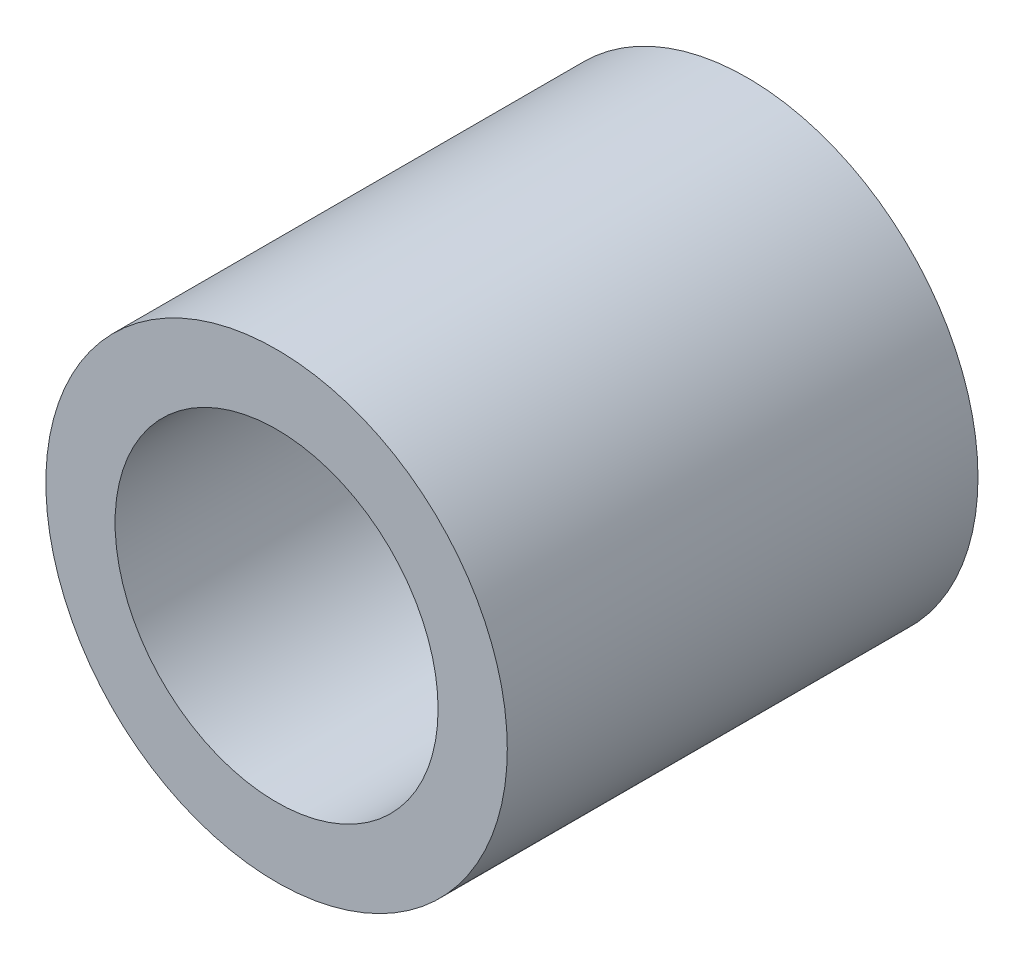
ISO-10303-21;
HEADER;
FILE_DESCRIPTION(('STEP AP214'),'2;1');
FILE_NAME('part.step','',(''),(''),'','','');
FILE_SCHEMA(('AUTOMOTIVE_DESIGN { 1 0 10303 214 1 1 1 1 }'));
ENDSEC;
DATA;
#1=APPLICATION_CONTEXT('core data for automotive mechanical design processes');
#2=APPLICATION_PROTOCOL_DEFINITION('international standard','automotive_design',2000,#1);
#3=PRODUCT_CONTEXT('',#1,'mechanical');
#4=PRODUCT('Part','Part','',(#3));
#5=PRODUCT_RELATED_PRODUCT_CATEGORY('part','',(#4));
#6=PRODUCT_DEFINITION_FORMATION('','',#4);
#7=PRODUCT_DEFINITION_CONTEXT('part definition',#1,'design');
#8=PRODUCT_DEFINITION('design','',#6,#7);
#9=PRODUCT_DEFINITION_SHAPE('','',#8);
#10=(LENGTH_UNIT() NAMED_UNIT(*) SI_UNIT(.MILLI.,.METRE.));
#11=(NAMED_UNIT(*) PLANE_ANGLE_UNIT() SI_UNIT($,.RADIAN.));
#12=(NAMED_UNIT(*) SI_UNIT($,.STERADIAN.) SOLID_ANGLE_UNIT());
#13=UNCERTAINTY_MEASURE_WITH_UNIT(LENGTH_MEASURE(1.E-05),#10,'distance_accuracy_value','');
#14=(GEOMETRIC_REPRESENTATION_CONTEXT(3) GLOBAL_UNCERTAINTY_ASSIGNED_CONTEXT((#13)) GLOBAL_UNIT_ASSIGNED_CONTEXT((#10,
#11,#12)) REPRESENTATION_CONTEXT('',''));
#15=CARTESIAN_POINT('',(0.,0.,0.));
#16=DIRECTION('',(0.,0.,1.));
#17=DIRECTION('',(1.,0.,0.));
#18=AXIS2_PLACEMENT_3D('',#15,#16,#17);
#19=CARTESIAN_POINT('',(0.,0.,51.));
#20=DIRECTION('',(0.,0.,1.));
#21=DIRECTION('',(1.,0.,0.));
#22=AXIS2_PLACEMENT_3D('',#19,#20,#21);
#23=PLANE('',#22);
#24=CARTESIAN_POINT('',(0.,0.,51.));
#25=DIRECTION('',(0.,0.,1.));
#26=DIRECTION('',(1.,0.,0.));
#27=AXIS2_PLACEMENT_3D('',#24,#25,#26);
#28=CIRCLE('',#27,25.);
#29=CARTESIAN_POINT('',(25.,0.,51.));
#30=VERTEX_POINT('',#29);
#31=EDGE_CURVE('E10',#30,#30,#28,.T.);
#32=ORIENTED_EDGE('',*,*,#31,.T.);
#33=EDGE_LOOP('',(#32));
#34=FACE_BOUND('',#33,.T.);
#35=CARTESIAN_POINT('',(0.,0.,51.));
#36=DIRECTION('',(0.,0.,1.));
#37=DIRECTION('',(1.,0.,0.));
#38=AXIS2_PLACEMENT_3D('',#35,#36,#37);
#39=CIRCLE('',#38,17.5);
#40=CARTESIAN_POINT('',(17.5,0.,51.));
#41=VERTEX_POINT('',#40);
#42=EDGE_CURVE('E40',#41,#41,#39,.T.);
#43=ORIENTED_EDGE('',*,*,#42,.F.);
#44=EDGE_LOOP('',(#43));
#45=FACE_BOUND('',#44,.T.);
#46=ADVANCED_FACE('F29',(#34,#45),#23,.T.);
#47=CARTESIAN_POINT('',(0.,0.,0.));
#48=DIRECTION('',(0.,0.,1.));
#49=DIRECTION('',(1.,0.,0.));
#50=AXIS2_PLACEMENT_3D('',#47,#48,#49);
#51=PLANE('',#50);
#52=CARTESIAN_POINT('',(0.,0.,0.));
#53=DIRECTION('',(0.,0.,1.));
#54=DIRECTION('',(1.,0.,0.));
#55=AXIS2_PLACEMENT_3D('',#52,#53,#54);
#56=CIRCLE('',#55,25.);
#57=CARTESIAN_POINT('',(25.,0.,0.));
#58=VERTEX_POINT('',#57);
#59=EDGE_CURVE('E33',#58,#58,#56,.T.);
#60=ORIENTED_EDGE('',*,*,#59,.F.);
#61=EDGE_LOOP('',(#60));
#62=FACE_BOUND('',#61,.T.);
#63=CARTESIAN_POINT('',(0.,0.,0.));
#64=DIRECTION('',(0.,0.,1.));
#65=DIRECTION('',(1.,0.,0.));
#66=AXIS2_PLACEMENT_3D('',#63,#64,#65);
#67=CIRCLE('',#66,17.5);
#68=CARTESIAN_POINT('',(17.5,0.,0.));
#69=VERTEX_POINT('',#68);
#70=EDGE_CURVE('E42',#69,#69,#67,.T.);
#71=ORIENTED_EDGE('',*,*,#70,.T.);
#72=EDGE_LOOP('',(#71));
#73=FACE_BOUND('',#72,.T.);
#74=ADVANCED_FACE('F52',(#62,#73),#51,.F.);
#75=CARTESIAN_POINT('',(0.,0.,51.));
#76=DIRECTION('',(0.,0.,-1.));
#77=DIRECTION('',(-1.,0.,0.));
#78=AXIS2_PLACEMENT_3D('',#75,#76,#77);
#79=CYLINDRICAL_SURFACE('',#78,25.);
#80=ORIENTED_EDGE('',*,*,#31,.F.);
#81=EDGE_LOOP('',(#80));
#82=FACE_BOUND('',#81,.T.);
#83=ORIENTED_EDGE('',*,*,#59,.T.);
#84=EDGE_LOOP('',(#83));
#85=FACE_BOUND('',#84,.T.);
#86=ADVANCED_FACE('F31',(#82,#85),#79,.T.);
#87=CARTESIAN_POINT('',(0.,0.,51.));
#88=DIRECTION('',(0.,0.,-1.));
#89=DIRECTION('',(-1.,0.,0.));
#90=AXIS2_PLACEMENT_3D('',#87,#88,#89);
#91=CYLINDRICAL_SURFACE('',#90,17.5);
#92=ORIENTED_EDGE('',*,*,#42,.T.);
#93=EDGE_LOOP('',(#92));
#94=FACE_BOUND('',#93,.T.);
#95=ORIENTED_EDGE('',*,*,#70,.F.);
#96=EDGE_LOOP('',(#95));
#97=FACE_BOUND('',#96,.T.);
#98=ADVANCED_FACE('F48',(#94,#97),#91,.F.);
#99=CLOSED_SHELL('',(#46,#74,#86,#98));
#100=MANIFOLD_SOLID_BREP('B2',#99);
#101=ADVANCED_BREP_SHAPE_REPRESENTATION('',(#18,#100),#14);
#102=SHAPE_DEFINITION_REPRESENTATION(#9,#101);
ENDSEC;
END-ISO-10303-21;
